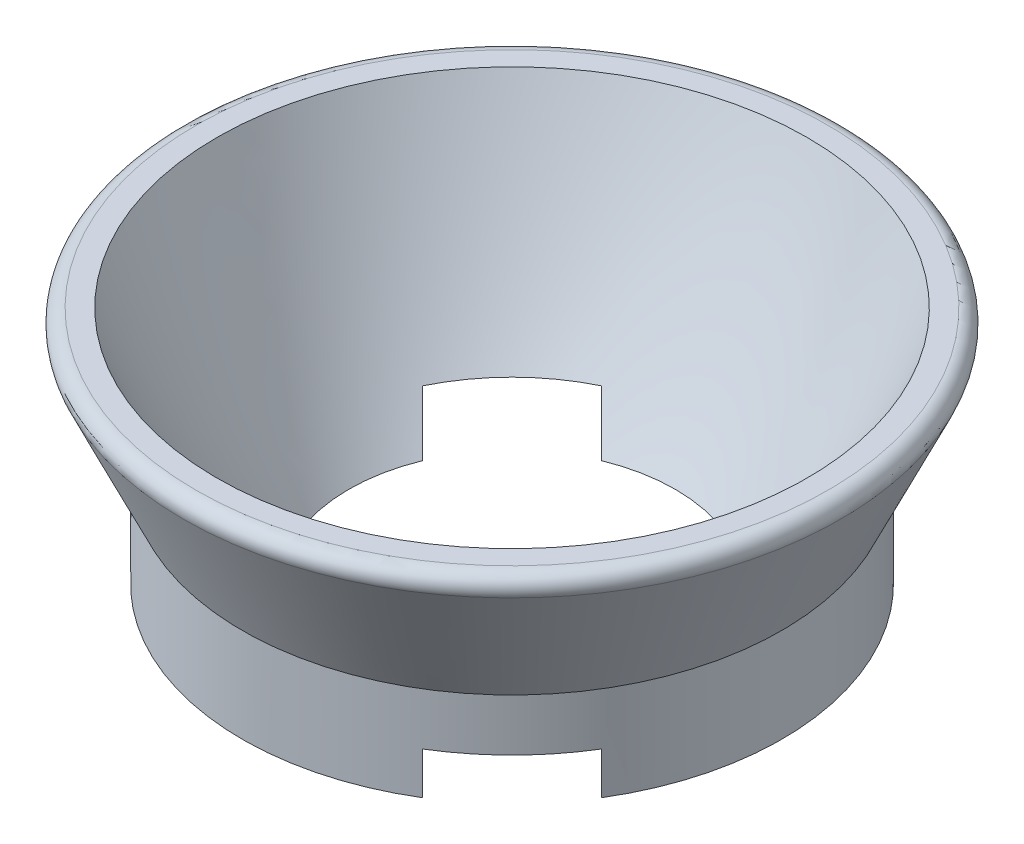
ISO-10303-21;
HEADER;
FILE_DESCRIPTION(('STEP AP214'),'2;1');
FILE_NAME('part.step','',(''),(''),'','','');
FILE_SCHEMA(('AUTOMOTIVE_DESIGN { 1 0 10303 214 1 1 1 1 }'));
ENDSEC;
DATA;
#1=APPLICATION_CONTEXT('core data for automotive mechanical design processes');
#2=APPLICATION_PROTOCOL_DEFINITION('international standard','automotive_design',2000,#1);
#3=PRODUCT_CONTEXT('',#1,'mechanical');
#4=PRODUCT('Part','Part','',(#3));
#5=PRODUCT_RELATED_PRODUCT_CATEGORY('part','',(#4));
#6=PRODUCT_DEFINITION_FORMATION('','',#4);
#7=PRODUCT_DEFINITION_CONTEXT('part definition',#1,'design');
#8=PRODUCT_DEFINITION('design','',#6,#7);
#9=PRODUCT_DEFINITION_SHAPE('','',#8);
#10=(LENGTH_UNIT() NAMED_UNIT(*) SI_UNIT(.MILLI.,.METRE.));
#11=(NAMED_UNIT(*) PLANE_ANGLE_UNIT() SI_UNIT($,.RADIAN.));
#12=(NAMED_UNIT(*) SI_UNIT($,.STERADIAN.) SOLID_ANGLE_UNIT());
#13=UNCERTAINTY_MEASURE_WITH_UNIT(LENGTH_MEASURE(1.E-05),#10,'distance_accuracy_value','');
#14=(GEOMETRIC_REPRESENTATION_CONTEXT(3) GLOBAL_UNCERTAINTY_ASSIGNED_CONTEXT((#13)) GLOBAL_UNIT_ASSIGNED_CONTEXT((#10,
#11,#12)) REPRESENTATION_CONTEXT('',''));
#15=CARTESIAN_POINT('',(0.,0.,0.));
#16=DIRECTION('',(0.,0.,1.));
#17=DIRECTION('',(1.,0.,0.));
#18=AXIS2_PLACEMENT_3D('',#15,#16,#17);
#19=CARTESIAN_POINT('',(-25.3111711425393,3.96875,-12.7));
#20=DIRECTION('',(0.,1.,0.));
#21=DIRECTION('',(0.,0.,1.));
#22=AXIS2_PLACEMENT_3D('',#19,#20,#21);
#23=PLANE('',#22);
#24=CARTESIAN_POINT('',(0.,3.96875,0.));
#25=DIRECTION('',(0.,1.,0.));
#26=DIRECTION('',(0.,0.,1.));
#27=AXIS2_PLACEMENT_3D('',#24,#25,#26);
#28=CIRCLE('',#27,10.16);
#29=CARTESIAN_POINT('',(-5.30029993041769,3.96875,-8.6678959758187));
#30=VERTEX_POINT('',#29);
#31=CARTESIAN_POINT('',(8.66789597581865,3.96875,5.30029993041779));
#32=VERTEX_POINT('',#31);
#33=EDGE_CURVE('E136',#30,#32,#28,.F.);
#34=ORIENTED_EDGE('',*,*,#33,.T.);
#35=DIRECTION('',(-0.707106781186544,0.,-0.707106781186552));
#36=VECTOR('',#35,1.);
#37=CARTESIAN_POINT('',(-17.321787548569,3.96875,-20.6893835939702));
#38=LINE('',#37,#36);
#39=CARTESIAN_POINT('',(5.6920390451129,3.96875,2.32444299971201));
#40=VERTEX_POINT('',#39);
#41=EDGE_CURVE('E211',#32,#40,#38,.T.);
#42=ORIENTED_EDGE('',*,*,#41,.T.);
#43=CARTESIAN_POINT('',(0.,3.96875,0.));
#44=DIRECTION('',(0.,-1.,0.));
#45=DIRECTION('',(0.,0.,-1.));
#46=AXIS2_PLACEMENT_3D('',#43,#44,#45);
#47=CIRCLE('',#46,6.14836106210427);
#48=CARTESIAN_POINT('',(-2.32444299971194,3.96875,-5.69203904511293));
#49=VERTEX_POINT('',#48);
#50=EDGE_CURVE('E131',#40,#49,#47,.F.);
#51=ORIENTED_EDGE('',*,*,#50,.T.);
#52=EDGE_CURVE('E213',#49,#30,#38,.T.);
#53=ORIENTED_EDGE('',*,*,#52,.T.);
#54=EDGE_LOOP('',(#34,#42,#51,#53));
#55=FACE_BOUND('',#54,.T.);
#56=ADVANCED_FACE('F43',(#55),#23,.F.);
#57=CARTESIAN_POINT('',(11.1125,12.9645833333333,0.));
#58=CARTESIAN_POINT('',(5.55624999999999,0.,0.));
#59=CARTESIAN_POINT('',(0.,0.,0.));
#60=B_SPLINE_CURVE_WITH_KNOTS('',2,(#57,#58,#59),.UNSPECIFIED.,.F.,.F.,(3,3),
(0.0860684515125903,0.946752966638492),.UNSPECIFIED.);
#61=CARTESIAN_POINT('',(0.,-0.851720162646575,0.));
#62=DIRECTION('',(0.,-1.,0.));
#63=AXIS1_PLACEMENT('',#61,#62);
#64=SURFACE_OF_REVOLUTION('',#60,#63);
#65=CARTESIAN_POINT('',(6.54450423103582,5.55625,3.17690818563494));
#66=CARTESIAN_POINT('',(6.49987574638495,5.46515471413862,3.13227970098407));
#67=CARTESIAN_POINT('',(6.45483289514058,5.37446384838,3.08723684973969));
#68=CARTESIAN_POINT('',(6.36389671973179,5.19400112538657,2.9963006743309));
#69=CARTESIAN_POINT('',(6.31800379004924,5.10422887047548,2.95040774464836));
#70=CARTESIAN_POINT('',(6.22531721433204,4.9256537171773,2.85772116893116));
#71=CARTESIAN_POINT('',(6.17852380159407,4.83685057681235,2.81092775619318));
#72=CARTESIAN_POINT('',(6.08397719290385,4.66026618733154,2.71638114750297));
#73=CARTESIAN_POINT('',(6.03622395991612,4.57248497785493,2.66862791451523));
#74=CARTESIAN_POINT('',(5.93970057191955,4.39801606726725,2.57210452651866));
#75=CARTESIAN_POINT('',(5.89093019837928,4.31132860770369,2.52333415297839));
#76=CARTESIAN_POINT('',(5.79230540179815,4.13912434067456,2.42470935639726));
#77=CARTESIAN_POINT('',(5.74245044720511,4.05360814229625,2.37485440180422));
#78=CARTESIAN_POINT('',(5.6920390451129,3.96875,2.32444299971201));
#79=B_SPLINE_CURVE_WITH_KNOTS('',3,(#65,#66,#67,#68,#69,#70,#71,#72,#73,#74,#75,#76,#77,#78),
.UNSPECIFIED.,.F.,.F.,(4,2,2,2,2,2,4),(0.,0.332468861738099,0.664787124619499,0.997020419865732,
1.32926655932279,1.66158483221107,1.99406981639375),.UNSPECIFIED.);
#80=CARTESIAN_POINT('',(6.54450423103578,5.55624999999992,3.1769081856349));
#81=VERTEX_POINT('',#80);
#82=EDGE_CURVE('E167',#81,#40,#79,.T.);
#83=ORIENTED_EDGE('',*,*,#82,.F.);
#84=CARTESIAN_POINT('',(0.,5.55624999999992,0.));
#85=DIRECTION('',(0.,-1.,0.));
#86=DIRECTION('',(0.,0.,-1.));
#87=AXIS2_PLACEMENT_3D('',#84,#85,#86);
#88=CIRCLE('',#87,7.27483891574234);
#89=CARTESIAN_POINT('',(3.17690818563483,5.55624999999992,6.54450423103581));
#90=VERTEX_POINT('',#89);
#91=EDGE_CURVE('E126',#81,#90,#88,.T.);
#92=ORIENTED_EDGE('',*,*,#91,.T.);
#93=CARTESIAN_POINT('',(2.32444299971195,3.96875,5.69203904511293));
#94=CARTESIAN_POINT('',(2.37485440180416,4.05360814229625,5.74245044720514));
#95=CARTESIAN_POINT('',(2.4247093563972,4.13912434067457,5.79230540179818));
#96=CARTESIAN_POINT('',(2.52333415297834,4.3113286077037,5.89093019837931));
#97=CARTESIAN_POINT('',(2.5721045265186,4.39801606726726,5.93970057191958));
#98=CARTESIAN_POINT('',(2.66862791451517,4.57248497785495,6.03622395991615));
#99=CARTESIAN_POINT('',(2.71638114750291,4.66026618733155,6.08397719290389));
#100=CARTESIAN_POINT('',(2.81092775619313,4.83685057681237,6.17852380159411));
#101=CARTESIAN_POINT('',(2.8577211689311,4.92565371717733,6.22531721433208));
#102=CARTESIAN_POINT('',(2.9504077446483,5.10422887047551,6.31800379004928));
#103=CARTESIAN_POINT('',(2.99630067433085,5.19400112538659,6.36389671973183));
#104=CARTESIAN_POINT('',(3.08723684973964,5.37446384838003,6.45483289514062));
#105=CARTESIAN_POINT('',(3.13227970098402,5.46515471413866,6.499875746385));
#106=CARTESIAN_POINT('',(3.17690818563488,5.55625000000004,6.54450423103587));
#107=B_SPLINE_CURVE_WITH_KNOTS('',3,(#93,#94,#95,#96,#97,#98,#99,#100,#101,#102,#103,#104,#105,
#106),.UNSPECIFIED.,.F.,.F.,(4,2,2,2,2,2,4),(0.,0.332484984182687,0.664803257070982,
0.997049396528042,1.32928269177428,1.66160095465569,1.99406981639379),.UNSPECIFIED.);
#108=CARTESIAN_POINT('',(2.32444299971195,3.96875,5.69203904511293));
#109=VERTEX_POINT('',#108);
#110=EDGE_CURVE('E110',#109,#90,#107,.T.);
#111=ORIENTED_EDGE('',*,*,#110,.F.);
#112=CARTESIAN_POINT('',(-5.6920390451129,3.96875,-2.32444299971201));
#113=VERTEX_POINT('',#112);
#114=EDGE_CURVE('E125',#113,#109,#47,.F.);
#115=ORIENTED_EDGE('',*,*,#114,.F.);
#116=CARTESIAN_POINT('',(-6.54450423103582,5.55625,-3.17690818563494));
#117=CARTESIAN_POINT('',(-6.49987574638495,5.46515471413862,-3.13227970098407));
#118=CARTESIAN_POINT('',(-6.45483289514058,5.37446384838,-3.08723684973969));
#119=CARTESIAN_POINT('',(-6.36389671973179,5.19400112538657,-2.9963006743309));
#120=CARTESIAN_POINT('',(-6.31800379004924,5.10422887047548,-2.95040774464836));
#121=CARTESIAN_POINT('',(-6.22531721433204,4.9256537171773,-2.85772116893116));
#122=CARTESIAN_POINT('',(-6.17852380159407,4.83685057681235,-2.81092775619319));
#123=CARTESIAN_POINT('',(-6.08397719290385,4.66026618733154,-2.71638114750297));
#124=CARTESIAN_POINT('',(-6.03622395991612,4.57248497785493,-2.66862791451523));
#125=CARTESIAN_POINT('',(-5.93970057191955,4.39801606726725,-2.57210452651866));
#126=CARTESIAN_POINT('',(-5.89093019837928,4.31132860770369,-2.52333415297839));
#127=CARTESIAN_POINT('',(-5.79230540179815,4.13912434067456,-2.42470935639726));
#128=CARTESIAN_POINT('',(-5.74245044720511,4.05360814229625,-2.37485440180422));
#129=CARTESIAN_POINT('',(-5.6920390451129,3.96875,-2.32444299971201));
#130=B_SPLINE_CURVE_WITH_KNOTS('',3,(#116,#117,#118,#119,#120,#121,#122,#123,#124,#125,#126,
#127,#128,#129),.UNSPECIFIED.,.F.,.F.,(4,2,2,2,2,2,4),(0.,0.3324688617381,0.6647871246195,
0.997020419865733,1.32926655932279,1.66158483221107,1.99406981639375),.UNSPECIFIED.);
#131=CARTESIAN_POINT('',(-6.54450423103578,5.55624999999992,-3.1769081856349));
#132=VERTEX_POINT('',#131);
#133=EDGE_CURVE('E66',#132,#113,#130,.T.);
#134=ORIENTED_EDGE('',*,*,#133,.F.);
#135=CARTESIAN_POINT('',(-3.17690818563482,5.55624999999992,-6.54450423103582));
#136=VERTEX_POINT('',#135);
#137=EDGE_CURVE('E139',#132,#136,#88,.T.);
#138=ORIENTED_EDGE('',*,*,#137,.T.);
#139=CARTESIAN_POINT('',(-2.32444299971195,3.96875,-5.69203904511293));
#140=CARTESIAN_POINT('',(-2.37485440180416,4.05360814229625,-5.74245044720514));
#141=CARTESIAN_POINT('',(-2.4247093563972,4.13912434067456,-5.79230540179818));
#142=CARTESIAN_POINT('',(-2.52333415297833,4.3113286077037,-5.89093019837932));
#143=CARTESIAN_POINT('',(-2.5721045265186,4.39801606726726,-5.93970057191958));
#144=CARTESIAN_POINT('',(-2.66862791451517,4.57248497785495,-6.03622395991616));
#145=CARTESIAN_POINT('',(-2.7163811475029,4.66026618733155,-6.08397719290389));
#146=CARTESIAN_POINT('',(-2.81092775619312,4.83685057681237,-6.17852380159411));
#147=CARTESIAN_POINT('',(-2.8577211689311,4.92565371717733,-6.22531721433209));
#148=CARTESIAN_POINT('',(-2.9504077446483,5.10422887047551,-6.31800379004929));
#149=CARTESIAN_POINT('',(-2.99630067433085,5.19400112538659,-6.36389671973183));
#150=CARTESIAN_POINT('',(-3.08723684973963,5.37446384838003,-6.45483289514063));
#151=CARTESIAN_POINT('',(-3.13227970098401,5.46515471413866,-6.499875746385));
#152=CARTESIAN_POINT('',(-3.17690818563488,5.55625000000004,-6.54450423103587));
#153=B_SPLINE_CURVE_WITH_KNOTS('',3,(#139,#140,#141,#142,#143,#144,#145,#146,#147,#148,#149,
#150,#151,#152),.UNSPECIFIED.,.F.,.F.,(4,2,2,2,2,2,4),(0.,0.332484984182686,0.664803257070982,
0.997049396528043,1.32928269177428,1.66160095465569,1.99406981639379),.UNSPECIFIED.);
#154=EDGE_CURVE('E173',#49,#136,#153,.T.);
#155=ORIENTED_EDGE('',*,*,#154,.F.);
#156=ORIENTED_EDGE('',*,*,#50,.F.);
#157=EDGE_LOOP('',(#83,#92,#111,#115,#134,#138,#155,#156));
#158=FACE_BOUND('',#157,.T.);
#159=CARTESIAN_POINT('',(0.,12.9645833333333,0.));
#160=DIRECTION('',(0.,-1.,0.));
#161=DIRECTION('',(0.,0.,-1.));
#162=AXIS2_PLACEMENT_3D('',#159,#160,#161);
#163=CIRCLE('',#162,11.1125);
#164=CARTESIAN_POINT('',(0.,12.9645833333333,-11.1125));
#165=VERTEX_POINT('',#164);
#166=EDGE_CURVE('E117',#165,#165,#163,.T.);
#167=ORIENTED_EDGE('',*,*,#166,.F.);
#168=EDGE_LOOP('',(#167));
#169=FACE_BOUND('',#168,.T.);
#170=ADVANCED_FACE('F123',(#158,#169),#64,.F.);
#171=CARTESIAN_POINT('',(11.1125,12.9645833333333,0.));
#172=DIRECTION('',(0.,1.,0.));
#173=DIRECTION('',(0.,0.,1.));
#174=AXIS2_PLACEMENT_3D('',#171,#172,#173);
#175=PLANE('',#174);
#176=CARTESIAN_POINT('',(0.,12.9645833333333,0.));
#177=DIRECTION('',(0.,1.,0.));
#178=DIRECTION('',(0.,0.,1.));
#179=AXIS2_PLACEMENT_3D('',#176,#177,#178);
#180=CIRCLE('',#179,11.9025997268243);
#181=CARTESIAN_POINT('',(0.,12.9645833333333,11.9025997268243));
#182=VERTEX_POINT('',#181);
#183=EDGE_CURVE('E12',#182,#182,#180,.T.);
#184=ORIENTED_EDGE('',*,*,#183,.T.);
#185=EDGE_LOOP('',(#184));
#186=FACE_BOUND('',#185,.T.);
#187=ORIENTED_EDGE('',*,*,#166,.T.);
#188=EDGE_LOOP('',(#187));
#189=FACE_BOUND('',#188,.T.);
#190=ADVANCED_FACE('F151',(#186,#189),#175,.T.);
#191=CARTESIAN_POINT('',(0.,7.5175357552391,0.));
#192=DIRECTION('',(0.,1.,0.));
#193=DIRECTION('',(0.,0.,1.));
#194=AXIS2_PLACEMENT_3D('',#191,#192,#193);
#195=CONICAL_SURFACE('',#194,10.16,0.436332312998588);
#196=CARTESIAN_POINT('',(0.,12.241893256369,0.));
#197=DIRECTION('',(0.,-1.,0.));
#198=DIRECTION('',(0.,0.,-1.));
#199=AXIS2_PLACEMENT_3D('',#196,#197,#198);
#200=CIRCLE('',#199,12.3630040826389);
#201=CARTESIAN_POINT('',(0.,12.241893256369,-12.3630040826389));
#202=VERTEX_POINT('',#201);
#203=EDGE_CURVE('E51',#202,#202,#200,.T.);
#204=ORIENTED_EDGE('',*,*,#203,.T.);
#205=EDGE_LOOP('',(#204));
#206=FACE_BOUND('',#205,.T.);
#207=CARTESIAN_POINT('',(0.,7.5175357552391,0.));
#208=DIRECTION('',(0.,-1.,0.));
#209=DIRECTION('',(0.,0.,-1.));
#210=AXIS2_PLACEMENT_3D('',#207,#208,#209);
#211=CIRCLE('',#210,10.16);
#212=CARTESIAN_POINT('',(0.,7.5175357552391,-10.16));
#213=VERTEX_POINT('',#212);
#214=EDGE_CURVE('E130',#213,#213,#211,.T.);
#215=ORIENTED_EDGE('',*,*,#214,.F.);
#216=EDGE_LOOP('',(#215));
#217=FACE_BOUND('',#216,.T.);
#218=ADVANCED_FACE('F193',(#206,#217),#195,.T.);
#219=CARTESIAN_POINT('',(0.,-0.851720162646575,0.));
#220=DIRECTION('',(0.,-1.,0.));
#221=DIRECTION('',(0.,0.,-1.));
#222=AXIS2_PLACEMENT_3D('',#219,#220,#221);
#223=CYLINDRICAL_SURFACE('',#222,10.16);
#224=DIRECTION('',(0.,-1.,0.));
#225=VECTOR('',#224,1.);
#226=CARTESIAN_POINT('',(-5.30029993041769,-0.851720162646575,-8.66789597581871));
#227=LINE('',#226,#225);
#228=CARTESIAN_POINT('',(-5.30029993041769,5.55625,-8.66789597581871));
#229=VERTEX_POINT('',#228);
#230=EDGE_CURVE('E127',#229,#30,#227,.T.);
#231=ORIENTED_EDGE('',*,*,#230,.F.);
#232=CARTESIAN_POINT('',(0.,5.55625,0.));
#233=DIRECTION('',(0.,-1.,0.));
#234=DIRECTION('',(0.,0.,-1.));
#235=AXIS2_PLACEMENT_3D('',#232,#233,#234);
#236=CIRCLE('',#235,10.16);
#237=CARTESIAN_POINT('',(-8.66789597581865,5.55625,-5.30029993041779));
#238=VERTEX_POINT('',#237);
#239=EDGE_CURVE('E222',#229,#238,#236,.F.);
#240=ORIENTED_EDGE('',*,*,#239,.T.);
#241=DIRECTION('',(0.,-1.,0.));
#242=VECTOR('',#241,1.);
#243=CARTESIAN_POINT('',(-8.66789597581865,-0.851720162646575,-5.30029993041779));
#244=LINE('',#243,#242);
#245=CARTESIAN_POINT('',(-8.66789597581864,3.96875,-5.30029993041778));
#246=VERTEX_POINT('',#245);
#247=EDGE_CURVE('E227',#246,#238,#244,.F.);
#248=ORIENTED_EDGE('',*,*,#247,.F.);
#249=CARTESIAN_POINT('',(5.3002999304177,3.96875,8.66789597581871));
#250=VERTEX_POINT('',#249);
#251=EDGE_CURVE('E216',#250,#246,#28,.F.);
#252=ORIENTED_EDGE('',*,*,#251,.F.);
#253=DIRECTION('',(0.,-1.,0.));
#254=VECTOR('',#253,1.);
#255=CARTESIAN_POINT('',(5.3002999304177,-0.851720162646575,8.66789597581871));
#256=LINE('',#255,#254);
#257=CARTESIAN_POINT('',(5.3002999304177,5.55625,8.6678959758187));
#258=VERTEX_POINT('',#257);
#259=EDGE_CURVE('E58',#258,#250,#256,.T.);
#260=ORIENTED_EDGE('',*,*,#259,.F.);
#261=CARTESIAN_POINT('',(8.66789597581865,5.55625,5.30029993041779));
#262=VERTEX_POINT('',#261);
#263=EDGE_CURVE('E220',#258,#262,#236,.F.);
#264=ORIENTED_EDGE('',*,*,#263,.T.);
#265=DIRECTION('',(0.,-1.,0.));
#266=VECTOR('',#265,1.);
#267=CARTESIAN_POINT('',(8.66789597581865,-0.851720162646575,5.30029993041779));
#268=LINE('',#267,#266);
#269=EDGE_CURVE('E174',#32,#262,#268,.F.);
#270=ORIENTED_EDGE('',*,*,#269,.F.);
#271=ORIENTED_EDGE('',*,*,#33,.F.);
#272=EDGE_LOOP('',(#231,#240,#248,#252,#260,#264,#270,#271));
#273=FACE_BOUND('',#272,.T.);
#274=ORIENTED_EDGE('',*,*,#214,.T.);
#275=EDGE_LOOP('',(#274));
#276=FACE_BOUND('',#275,.T.);
#277=ADVANCED_FACE('F191',(#273,#276),#223,.T.);
#278=ORIENTED_EDGE('',*,*,#251,.T.);
#279=DIRECTION('',(0.707106781186544,0.,0.707106781186551));
#280=VECTOR('',#279,1.);
#281=CARTESIAN_POINT('',(-20.68938359397,3.96875,-17.3217875485693));
#282=LINE('',#281,#280);
#283=EDGE_CURVE('E116',#246,#113,#282,.T.);
#284=ORIENTED_EDGE('',*,*,#283,.T.);
#285=ORIENTED_EDGE('',*,*,#114,.T.);
#286=EDGE_CURVE('E107',#109,#250,#282,.T.);
#287=ORIENTED_EDGE('',*,*,#286,.T.);
#288=EDGE_LOOP('',(#278,#284,#285,#287));
#289=FACE_BOUND('',#288,.T.);
#290=ADVANCED_FACE('F129',(#289),#23,.F.);
#291=CARTESIAN_POINT('',(8.62237032246324,5.55625,11.9899663678643));
#292=DIRECTION('',(-0.707106781186551,0.,0.707106781186544));
#293=DIRECTION('',(0.707106781186544,0.,0.707106781186551));
#294=AXIS2_PLACEMENT_3D('',#291,#292,#293);
#295=PLANE('',#294);
#296=ORIENTED_EDGE('',*,*,#110,.T.);
#297=DIRECTION('',(-0.707106781186544,0.,-0.707106781186551));
#298=VECTOR('',#297,1.);
#299=CARTESIAN_POINT('',(8.62237032246324,5.55625,11.9899663678643));
#300=LINE('',#299,#298);
#301=EDGE_CURVE('E240',#258,#90,#300,.T.);
#302=ORIENTED_EDGE('',*,*,#301,.F.);
#303=ORIENTED_EDGE('',*,*,#259,.T.);
#304=ORIENTED_EDGE('',*,*,#286,.F.);
#305=EDGE_LOOP('',(#296,#302,#303,#304));
#306=FACE_BOUND('',#305,.T.);
#307=ADVANCED_FACE('F109',(#306),#295,.F.);
#308=CARTESIAN_POINT('',(11.9899663678642,5.55625,8.62237032246338));
#309=DIRECTION('',(0.707106781186551,0.,-0.707106781186543));
#310=DIRECTION('',(-0.707106781186544,0.,-0.707106781186552));
#311=AXIS2_PLACEMENT_3D('',#308,#309,#310);
#312=PLANE('',#311);
#313=ORIENTED_EDGE('',*,*,#82,.T.);
#314=ORIENTED_EDGE('',*,*,#41,.F.);
#315=ORIENTED_EDGE('',*,*,#269,.T.);
#316=DIRECTION('',(0.707106781186543,0.,0.707106781186551));
#317=VECTOR('',#316,1.);
#318=CARTESIAN_POINT('',(11.9899663678642,5.55625,8.62237032246338));
#319=LINE('',#318,#317);
#320=EDGE_CURVE('E238',#81,#262,#319,.T.);
#321=ORIENTED_EDGE('',*,*,#320,.F.);
#322=EDGE_LOOP('',(#313,#314,#315,#321));
#323=FACE_BOUND('',#322,.T.);
#324=ADVANCED_FACE('F178',(#323),#312,.F.);
#325=CARTESIAN_POINT('',(0.,5.55625,0.));
#326=DIRECTION('',(0.,-1.,0.));
#327=DIRECTION('',(0.,0.,-1.));
#328=AXIS2_PLACEMENT_3D('',#325,#326,#327);
#329=PLANE('',#328);
#330=ORIENTED_EDGE('',*,*,#320,.T.);
#331=ORIENTED_EDGE('',*,*,#263,.F.);
#332=ORIENTED_EDGE('',*,*,#301,.T.);
#333=ORIENTED_EDGE('',*,*,#91,.F.);
#334=EDGE_LOOP('',(#330,#331,#332,#333));
#335=FACE_BOUND('',#334,.T.);
#336=ADVANCED_FACE('F182',(#335),#329,.T.);
#337=ORIENTED_EDGE('',*,*,#154,.T.);
#338=EDGE_CURVE('E233',#229,#136,#319,.T.);
#339=ORIENTED_EDGE('',*,*,#338,.F.);
#340=ORIENTED_EDGE('',*,*,#230,.T.);
#341=ORIENTED_EDGE('',*,*,#52,.F.);
#342=EDGE_LOOP('',(#337,#339,#340,#341));
#343=FACE_BOUND('',#342,.T.);
#344=ADVANCED_FACE('F184',(#343),#312,.F.);
#345=ORIENTED_EDGE('',*,*,#133,.T.);
#346=ORIENTED_EDGE('',*,*,#283,.F.);
#347=ORIENTED_EDGE('',*,*,#247,.T.);
#348=EDGE_CURVE('E235',#132,#238,#300,.T.);
#349=ORIENTED_EDGE('',*,*,#348,.F.);
#350=EDGE_LOOP('',(#345,#346,#347,#349));
#351=FACE_BOUND('',#350,.T.);
#352=ADVANCED_FACE('F185',(#351),#295,.F.);
#353=ORIENTED_EDGE('',*,*,#348,.T.);
#354=ORIENTED_EDGE('',*,*,#239,.F.);
#355=ORIENTED_EDGE('',*,*,#338,.T.);
#356=ORIENTED_EDGE('',*,*,#137,.F.);
#357=EDGE_LOOP('',(#353,#354,#355,#356));
#358=FACE_BOUND('',#357,.T.);
#359=ADVANCED_FACE('F232',(#358),#329,.T.);
#360=CARTESIAN_POINT('',(0.,12.4565833333333,0.));
#361=DIRECTION('',(0.,1.,0.));
#362=DIRECTION('',(0.,0.,1.));
#363=AXIS2_PLACEMENT_3D('',#360,#361,#362);
#364=TOROIDAL_SURFACE('',#363,11.9025997268243,0.508);
#365=ORIENTED_EDGE('',*,*,#183,.F.);
#366=EDGE_LOOP('',(#365));
#367=FACE_BOUND('',#366,.T.);
#368=ORIENTED_EDGE('',*,*,#203,.F.);
#369=EDGE_LOOP('',(#368));
#370=FACE_BOUND('',#369,.T.);
#371=ADVANCED_FACE('F45',(#367,#370),#364,.T.);
#372=CLOSED_SHELL('',(#56,#170,#190,#218,#277,#290,#307,#324,#336,#344,#352,#359,#371));
#373=MANIFOLD_SOLID_BREP('B2',#372);
#374=ADVANCED_BREP_SHAPE_REPRESENTATION('',(#18,#373),#14);
#375=SHAPE_DEFINITION_REPRESENTATION(#9,#374);
ENDSEC;
END-ISO-10303-21;
